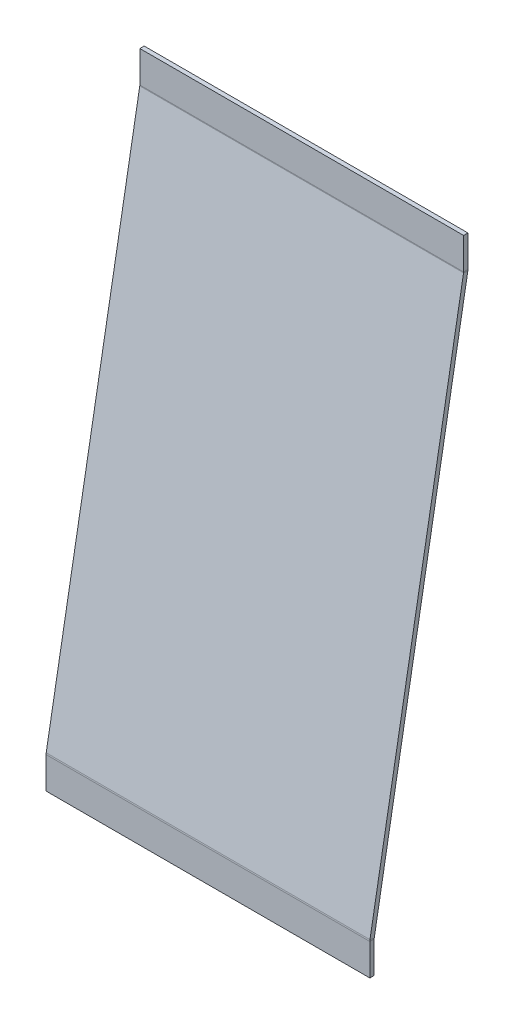
ISO-10303-21;
HEADER;
FILE_DESCRIPTION(('STEP AP214'),'2;1');
FILE_NAME('part.step','',(''),(''),'','','');
FILE_SCHEMA(('AUTOMOTIVE_DESIGN { 1 0 10303 214 1 1 1 1 }'));
ENDSEC;
DATA;
#1=APPLICATION_CONTEXT('core data for automotive mechanical design processes');
#2=APPLICATION_PROTOCOL_DEFINITION('international standard','automotive_design',2000,#1);
#3=PRODUCT_CONTEXT('',#1,'mechanical');
#4=PRODUCT('Part','Part','',(#3));
#5=PRODUCT_RELATED_PRODUCT_CATEGORY('part','',(#4));
#6=PRODUCT_DEFINITION_FORMATION('','',#4);
#7=PRODUCT_DEFINITION_CONTEXT('part definition',#1,'design');
#8=PRODUCT_DEFINITION('design','',#6,#7);
#9=PRODUCT_DEFINITION_SHAPE('','',#8);
#10=(LENGTH_UNIT() NAMED_UNIT(*) SI_UNIT(.MILLI.,.METRE.));
#11=(NAMED_UNIT(*) PLANE_ANGLE_UNIT() SI_UNIT($,.RADIAN.));
#12=(NAMED_UNIT(*) SI_UNIT($,.STERADIAN.) SOLID_ANGLE_UNIT());
#13=UNCERTAINTY_MEASURE_WITH_UNIT(LENGTH_MEASURE(1.E-05),#10,'distance_accuracy_value','');
#14=(GEOMETRIC_REPRESENTATION_CONTEXT(3) GLOBAL_UNCERTAINTY_ASSIGNED_CONTEXT((#13)) GLOBAL_UNIT_ASSIGNED_CONTEXT((#10,
#11,#12)) REPRESENTATION_CONTEXT('',''));
#15=CARTESIAN_POINT('',(0.,0.,0.));
#16=DIRECTION('',(0.,0.,1.));
#17=DIRECTION('',(1.,0.,0.));
#18=AXIS2_PLACEMENT_3D('',#15,#16,#17);
#19=CARTESIAN_POINT('',(0.,0.0347296355333861,0.196961550602442));
#20=DIRECTION('',(1.,0.,0.));
#21=DIRECTION('',(0.,-0.984807753012208,0.173648177666931));
#22=AXIS2_PLACEMENT_3D('',#19,#20,#21);
#23=PLANE('',#22);
#24=DIRECTION('',(0.,0.984807753012208,-0.173648177666931));
#25=VECTOR('',#24,1.);
#26=CARTESIAN_POINT('',(0.,-0.0347296355333862,-0.196961550602442));
#27=LINE('',#26,#25);
#28=CARTESIAN_POINT('',(0.,49.1711942094205,-8.87329353515391));
#29=VERTEX_POINT('',#28);
#30=CARTESIAN_POINT('',(0.,-0.000265829876988972,-0.203038449397557));
#31=VERTEX_POINT('',#30);
#32=EDGE_CURVE('E244',#29,#31,#27,.F.);
#33=ORIENTED_EDGE('',*,*,#32,.T.);
#34=DIRECTION('',(0.,0.17364817766693,0.984807753012208));
#35=VECTOR('',#34,1.);
#36=CARTESIAN_POINT('',(0.,-0.00026582987699442,-0.20303844939759));
#37=LINE('',#36,#35);
#38=CARTESIAN_POINT('',(0.,0.0691934411897775,0.190884651807293));
#39=VERTEX_POINT('',#38);
#40=EDGE_CURVE('E181',#31,#39,#37,.T.);
#41=ORIENTED_EDGE('',*,*,#40,.T.);
#42=DIRECTION('',(0.,-0.984807753012208,0.173648177666931));
#43=VECTOR('',#42,1.);
#44=CARTESIAN_POINT('',(0.,0.0347296355333861,0.196961550602442));
#45=LINE('',#44,#43);
#46=CARTESIAN_POINT('',(0.,49.2406534804873,-8.47937043394903));
#47=VERTEX_POINT('',#46);
#48=EDGE_CURVE('E54',#47,#39,#45,.T.);
#49=ORIENTED_EDGE('',*,*,#48,.F.);
#50=DIRECTION('',(0.,-0.173648177666959,-0.984807753012203));
#51=VECTOR('',#50,1.);
#52=CARTESIAN_POINT('',(0.,49.2406534804873,-8.47937043394903));
#53=LINE('',#52,#51);
#54=EDGE_CURVE('E231',#47,#29,#53,.T.);
#55=ORIENTED_EDGE('',*,*,#54,.T.);
#56=EDGE_LOOP('',(#33,#41,#49,#55));
#57=FACE_BOUND('',#56,.T.);
#58=ADVANCED_FACE('F45',(#57),#23,.F.);
#59=CARTESIAN_POINT('',(30.,0.0347296355333861,0.196961550602442));
#60=DIRECTION('',(0.,-0.173648177666931,-0.984807753012208));
#61=DIRECTION('',(0.,0.984807753012208,-0.173648177666931));
#62=AXIS2_PLACEMENT_3D('',#59,#60,#61);
#63=PLANE('',#62);
#64=DIRECTION('',(-1.,0.,0.));
#65=VECTOR('',#64,1.);
#66=CARTESIAN_POINT('',(0.,0.0691934411897775,0.190884651807293));
#67=LINE('',#66,#65);
#68=CARTESIAN_POINT('',(30.,0.069193441189783,0.190884651807326));
#69=VERTEX_POINT('',#68);
#70=EDGE_CURVE('E174',#39,#69,#67,.F.);
#71=ORIENTED_EDGE('',*,*,#70,.T.);
#72=DIRECTION('',(0.,-0.984807753012208,0.173648177666931));
#73=VECTOR('',#72,1.);
#74=CARTESIAN_POINT('',(30.,0.0347296355333861,0.196961550602442));
#75=LINE('',#74,#73);
#76=CARTESIAN_POINT('',(30.,49.2406534804873,-8.47937043394897));
#77=VERTEX_POINT('',#76);
#78=EDGE_CURVE('E11',#77,#69,#75,.T.);
#79=ORIENTED_EDGE('',*,*,#78,.F.);
#80=DIRECTION('',(-1.,0.,0.));
#81=VECTOR('',#80,1.);
#82=CARTESIAN_POINT('',(0.,49.2406534804873,-8.47937043394903));
#83=LINE('',#82,#81);
#84=EDGE_CURVE('E237',#47,#77,#83,.F.);
#85=ORIENTED_EDGE('',*,*,#84,.F.);
#86=ORIENTED_EDGE('',*,*,#48,.T.);
#87=EDGE_LOOP('',(#71,#79,#85,#86));
#88=FACE_BOUND('',#87,.T.);
#89=ADVANCED_FACE('F283',(#88),#63,.F.);
#90=CARTESIAN_POINT('',(30.,-0.0347296355333862,-0.196961550602442));
#91=DIRECTION('',(0.,-0.173648177666931,-0.984807753012208));
#92=DIRECTION('',(0.,0.984807753012208,-0.173648177666931));
#93=AXIS2_PLACEMENT_3D('',#90,#91,#92);
#94=PLANE('',#93);
#95=DIRECTION('',(0.,0.984807753012208,-0.173648177666931));
#96=VECTOR('',#95,1.);
#97=CARTESIAN_POINT('',(30.,-0.0347296355333862,-0.196961550602442));
#98=LINE('',#97,#96);
#99=CARTESIAN_POINT('',(30.,49.1711942094206,-8.87329353515385));
#100=VERTEX_POINT('',#99);
#101=CARTESIAN_POINT('',(30.,-0.000265829876989304,-0.203038449397557));
#102=VERTEX_POINT('',#101);
#103=EDGE_CURVE('E49',#100,#102,#98,.F.);
#104=ORIENTED_EDGE('',*,*,#103,.T.);
#105=DIRECTION('',(-1.,0.,0.));
#106=VECTOR('',#105,1.);
#107=CARTESIAN_POINT('',(0.,-0.00026582987699442,-0.20303844939759));
#108=LINE('',#107,#106);
#109=EDGE_CURVE('E62',#31,#102,#108,.F.);
#110=ORIENTED_EDGE('',*,*,#109,.F.);
#111=ORIENTED_EDGE('',*,*,#32,.F.);
#112=DIRECTION('',(-1.,0.,0.));
#113=VECTOR('',#112,1.);
#114=CARTESIAN_POINT('',(0.,49.1711942094205,-8.87329353515391));
#115=LINE('',#114,#113);
#116=EDGE_CURVE('E224',#29,#100,#115,.F.);
#117=ORIENTED_EDGE('',*,*,#116,.T.);
#118=EDGE_LOOP('',(#104,#110,#111,#117));
#119=FACE_BOUND('',#118,.T.);
#120=ADVANCED_FACE('F249',(#119),#94,.T.);
#121=CARTESIAN_POINT('',(30.,0.0347296355333861,0.196961550602442));
#122=DIRECTION('',(1.,0.,0.));
#123=DIRECTION('',(0.,-0.984807753012208,0.173648177666931));
#124=AXIS2_PLACEMENT_3D('',#121,#122,#123);
#125=PLANE('',#124);
#126=DIRECTION('',(0.,0.17364817766693,0.984807753012208));
#127=VECTOR('',#126,1.);
#128=CARTESIAN_POINT('',(30.,-0.000265829876989337,-0.203038449397558));
#129=LINE('',#128,#127);
#130=EDGE_CURVE('E69',#102,#69,#129,.T.);
#131=ORIENTED_EDGE('',*,*,#130,.F.);
#132=ORIENTED_EDGE('',*,*,#103,.F.);
#133=DIRECTION('',(0.,-0.173648177666958,-0.984807753012203));
#134=VECTOR('',#133,1.);
#135=CARTESIAN_POINT('',(30.,49.2406534804873,-8.47937043394897));
#136=LINE('',#135,#134);
#137=EDGE_CURVE('E241',#77,#100,#136,.T.);
#138=ORIENTED_EDGE('',*,*,#137,.F.);
#139=ORIENTED_EDGE('',*,*,#78,.T.);
#140=EDGE_LOOP('',(#131,#132,#138,#139));
#141=FACE_BOUND('',#140,.T.);
#142=ADVANCED_FACE('F47',(#141),#125,.T.);
#143=CARTESIAN_POINT('',(30.,49.3101127515541,-8.08544733274406));
#144=DIRECTION('',(1.,0.,0.));
#145=DIRECTION('',(0.,0.,-1.));
#146=AXIS2_PLACEMENT_3D('',#143,#144,#145);
#147=PLANE('',#146);
#148=DIRECTION('',(0.,0.,-1.));
#149=VECTOR('',#148,1.);
#150=CARTESIAN_POINT('',(30.,49.3101127515541,-8.48544733274409));
#151=LINE('',#150,#149);
#152=CARTESIAN_POINT('',(30.,49.3101127515541,-8.48544733274409));
#153=VERTEX_POINT('',#152);
#154=CARTESIAN_POINT('',(30.,49.3101127515541,-8.88544733274409));
#155=VERTEX_POINT('',#154);
#156=EDGE_CURVE('E191',#153,#155,#151,.T.);
#157=ORIENTED_EDGE('',*,*,#156,.F.);
#158=CARTESIAN_POINT('',(30.,49.3101127515541,-8.08544733274406));
#159=DIRECTION('',(-1.,0.,0.));
#160=DIRECTION('',(0.,0.,1.));
#161=AXIS2_PLACEMENT_3D('',#158,#159,#160);
#162=CIRCLE('',#161,0.400000000000025);
#163=EDGE_CURVE('E234',#77,#153,#162,.F.);
#164=ORIENTED_EDGE('',*,*,#163,.F.);
#165=ORIENTED_EDGE('',*,*,#137,.T.);
#166=CARTESIAN_POINT('',(30.,49.3101127515541,-8.08544733274406));
#167=DIRECTION('',(-1.,0.,0.));
#168=DIRECTION('',(0.,0.,1.));
#169=AXIS2_PLACEMENT_3D('',#166,#167,#168);
#170=CIRCLE('',#169,0.800000000000025);
#171=EDGE_CURVE('E227',#100,#155,#170,.F.);
#172=ORIENTED_EDGE('',*,*,#171,.T.);
#173=EDGE_LOOP('',(#157,#164,#165,#172));
#174=FACE_BOUND('',#173,.T.);
#175=ADVANCED_FACE('F297',(#174),#147,.T.);
#176=CARTESIAN_POINT('',(0.,49.3101127515541,-8.08544733274413));
#177=DIRECTION('',(1.,0.,0.));
#178=DIRECTION('',(0.,0.,-1.));
#179=AXIS2_PLACEMENT_3D('',#176,#177,#178);
#180=PLANE('',#179);
#181=CARTESIAN_POINT('',(0.,49.3101127515541,-8.08544733274413));
#182=DIRECTION('',(-1.,0.,0.));
#183=DIRECTION('',(0.,0.,1.));
#184=AXIS2_PLACEMENT_3D('',#181,#182,#183);
#185=CIRCLE('',#184,0.400000000000025);
#186=CARTESIAN_POINT('',(0.,49.3101127515541,-8.48544733274415));
#187=VERTEX_POINT('',#186);
#188=EDGE_CURVE('E223',#187,#47,#185,.T.);
#189=ORIENTED_EDGE('',*,*,#188,.F.);
#190=DIRECTION('',(0.,0.,-1.));
#191=VECTOR('',#190,1.);
#192=CARTESIAN_POINT('',(0.,49.3101127515541,-8.48544733274409));
#193=LINE('',#192,#191);
#194=CARTESIAN_POINT('',(0.,49.3101127515541,-8.88544733274409));
#195=VERTEX_POINT('',#194);
#196=EDGE_CURVE('E196',#187,#195,#193,.T.);
#197=ORIENTED_EDGE('',*,*,#196,.T.);
#198=CARTESIAN_POINT('',(0.,49.3101127515541,-8.08544733274413));
#199=DIRECTION('',(-1.,0.,0.));
#200=DIRECTION('',(0.,0.,1.));
#201=AXIS2_PLACEMENT_3D('',#198,#199,#200);
#202=CIRCLE('',#201,0.800000000000025);
#203=EDGE_CURVE('E228',#195,#29,#202,.T.);
#204=ORIENTED_EDGE('',*,*,#203,.T.);
#205=ORIENTED_EDGE('',*,*,#54,.F.);
#206=EDGE_LOOP('',(#189,#197,#204,#205));
#207=FACE_BOUND('',#206,.T.);
#208=ADVANCED_FACE('F293',(#207),#180,.F.);
#209=CARTESIAN_POINT('',(0.,49.3101127515541,-8.08544733274413));
#210=DIRECTION('',(-1.,0.,0.));
#211=DIRECTION('',(0.,0.,-1.));
#212=AXIS2_PLACEMENT_3D('',#209,#210,#211);
#213=CYLINDRICAL_SURFACE('',#212,0.800000000000025);
#214=ORIENTED_EDGE('',*,*,#116,.F.);
#215=ORIENTED_EDGE('',*,*,#203,.F.);
#216=DIRECTION('',(1.,0.,0.));
#217=VECTOR('',#216,1.);
#218=CARTESIAN_POINT('',(0.,49.3101127515541,-8.88544733274409));
#219=LINE('',#218,#217);
#220=EDGE_CURVE('E199',#195,#155,#219,.T.);
#221=ORIENTED_EDGE('',*,*,#220,.T.);
#222=ORIENTED_EDGE('',*,*,#171,.F.);
#223=EDGE_LOOP('',(#214,#215,#221,#222));
#224=FACE_BOUND('',#223,.T.);
#225=ADVANCED_FACE('F296',(#224),#213,.T.);
#226=CARTESIAN_POINT('',(0.,49.3101127515541,-8.08544733274413));
#227=DIRECTION('',(-1.,0.,0.));
#228=DIRECTION('',(0.,0.,-1.));
#229=AXIS2_PLACEMENT_3D('',#226,#227,#228);
#230=CYLINDRICAL_SURFACE('',#229,0.400000000000025);
#231=ORIENTED_EDGE('',*,*,#84,.T.);
#232=ORIENTED_EDGE('',*,*,#163,.T.);
#233=DIRECTION('',(-1.,0.,0.));
#234=VECTOR('',#233,1.);
#235=CARTESIAN_POINT('',(30.,49.3101127515541,-8.48544733274409));
#236=LINE('',#235,#234);
#237=EDGE_CURVE('E194',#153,#187,#236,.T.);
#238=ORIENTED_EDGE('',*,*,#237,.T.);
#239=ORIENTED_EDGE('',*,*,#188,.T.);
#240=EDGE_LOOP('',(#231,#232,#238,#239));
#241=FACE_BOUND('',#240,.T.);
#242=ADVANCED_FACE('F302',(#241),#230,.F.);
#243=CARTESIAN_POINT('',(0.,52.2401218207334,-8.88544733274411));
#244=DIRECTION('',(1.,0.,0.));
#245=DIRECTION('',(0.,0.,-1.));
#246=AXIS2_PLACEMENT_3D('',#243,#244,#245);
#247=PLANE('',#246);
#248=ORIENTED_EDGE('',*,*,#196,.F.);
#249=DIRECTION('',(0.,1.,0.));
#250=VECTOR('',#249,1.);
#251=CARTESIAN_POINT('',(0.,52.2401218207334,-8.48544733274411));
#252=LINE('',#251,#250);
#253=CARTESIAN_POINT('',(0.,52.2401218207334,-8.48544733274411));
#254=VERTEX_POINT('',#253);
#255=EDGE_CURVE('E203',#187,#254,#252,.T.);
#256=ORIENTED_EDGE('',*,*,#255,.T.);
#257=DIRECTION('',(0.,0.,1.));
#258=VECTOR('',#257,1.);
#259=CARTESIAN_POINT('',(0.,52.2401218207334,-8.88544733274411));
#260=LINE('',#259,#258);
#261=CARTESIAN_POINT('',(0.,52.2401218207334,-8.88544733274411));
#262=VERTEX_POINT('',#261);
#263=EDGE_CURVE('E220',#262,#254,#260,.T.);
#264=ORIENTED_EDGE('',*,*,#263,.F.);
#265=DIRECTION('',(0.,1.,0.));
#266=VECTOR('',#265,1.);
#267=CARTESIAN_POINT('',(0.,52.2401218207334,-8.88544733274411));
#268=LINE('',#267,#266);
#269=EDGE_CURVE('E204',#195,#262,#268,.T.);
#270=ORIENTED_EDGE('',*,*,#269,.F.);
#271=EDGE_LOOP('',(#248,#256,#264,#270));
#272=FACE_BOUND('',#271,.T.);
#273=ADVANCED_FACE('F305',(#272),#247,.F.);
#274=CARTESIAN_POINT('',(30.,49.2751172861437,-8.88544733274409));
#275=DIRECTION('',(-1.,0.,0.));
#276=DIRECTION('',(0.,0.,1.));
#277=AXIS2_PLACEMENT_3D('',#274,#275,#276);
#278=PLANE('',#277);
#279=ORIENTED_EDGE('',*,*,#156,.T.);
#280=DIRECTION('',(0.,-1.,0.));
#281=VECTOR('',#280,1.);
#282=CARTESIAN_POINT('',(30.,49.2751172861437,-8.88544733274409));
#283=LINE('',#282,#281);
#284=CARTESIAN_POINT('',(30.,52.2401218207334,-8.88544733274411));
#285=VERTEX_POINT('',#284);
#286=EDGE_CURVE('E209',#285,#155,#283,.T.);
#287=ORIENTED_EDGE('',*,*,#286,.F.);
#288=DIRECTION('',(0.,0.,1.));
#289=VECTOR('',#288,1.);
#290=CARTESIAN_POINT('',(30.,52.2401218207334,-8.88544733274411));
#291=LINE('',#290,#289);
#292=CARTESIAN_POINT('',(30.,52.2401218207334,-8.48544733274411));
#293=VERTEX_POINT('',#292);
#294=EDGE_CURVE('E212',#285,#293,#291,.T.);
#295=ORIENTED_EDGE('',*,*,#294,.T.);
#296=DIRECTION('',(0.,-1.,0.));
#297=VECTOR('',#296,1.);
#298=CARTESIAN_POINT('',(30.,49.2751172861437,-8.48544733274409));
#299=LINE('',#298,#297);
#300=EDGE_CURVE('E207',#293,#153,#299,.T.);
#301=ORIENTED_EDGE('',*,*,#300,.T.);
#302=EDGE_LOOP('',(#279,#287,#295,#301));
#303=FACE_BOUND('',#302,.T.);
#304=ADVANCED_FACE('F312',(#303),#278,.F.);
#305=CARTESIAN_POINT('',(0.,0.,-8.88544733274374));
#306=DIRECTION('',(0.,0.,1.));
#307=DIRECTION('',(0.,-1.,0.));
#308=AXIS2_PLACEMENT_3D('',#305,#306,#307);
#309=PLANE('',#308);
#310=ORIENTED_EDGE('',*,*,#220,.F.);
#311=ORIENTED_EDGE('',*,*,#269,.T.);
#312=DIRECTION('',(1.,0.,0.));
#313=VECTOR('',#312,1.);
#314=CARTESIAN_POINT('',(30.,52.2401218207334,-8.88544733274411));
#315=LINE('',#314,#313);
#316=EDGE_CURVE('E206',#262,#285,#315,.T.);
#317=ORIENTED_EDGE('',*,*,#316,.T.);
#318=ORIENTED_EDGE('',*,*,#286,.T.);
#319=EDGE_LOOP('',(#310,#311,#317,#318));
#320=FACE_BOUND('',#319,.T.);
#321=ADVANCED_FACE('F320',(#320),#309,.F.);
#322=CARTESIAN_POINT('',(0.,0.,-8.48544733274374));
#323=DIRECTION('',(0.,0.,1.));
#324=DIRECTION('',(0.,-1.,0.));
#325=AXIS2_PLACEMENT_3D('',#322,#323,#324);
#326=PLANE('',#325);
#327=ORIENTED_EDGE('',*,*,#255,.F.);
#328=ORIENTED_EDGE('',*,*,#237,.F.);
#329=ORIENTED_EDGE('',*,*,#300,.F.);
#330=DIRECTION('',(1.,0.,0.));
#331=VECTOR('',#330,1.);
#332=CARTESIAN_POINT('',(30.,52.2401218207334,-8.48544733274411));
#333=LINE('',#332,#331);
#334=EDGE_CURVE('E214',#254,#293,#333,.T.);
#335=ORIENTED_EDGE('',*,*,#334,.F.);
#336=EDGE_LOOP('',(#327,#328,#329,#335));
#337=FACE_BOUND('',#336,.T.);
#338=ADVANCED_FACE('F316',(#337),#326,.T.);
#339=CARTESIAN_POINT('',(30.,52.2401218207334,-8.88544733274411));
#340=DIRECTION('',(0.,-1.,0.));
#341=DIRECTION('',(0.,0.,-1.));
#342=AXIS2_PLACEMENT_3D('',#339,#340,#341);
#343=PLANE('',#342);
#344=ORIENTED_EDGE('',*,*,#334,.T.);
#345=ORIENTED_EDGE('',*,*,#294,.F.);
#346=ORIENTED_EDGE('',*,*,#316,.F.);
#347=ORIENTED_EDGE('',*,*,#263,.T.);
#348=EDGE_LOOP('',(#344,#345,#346,#347));
#349=FACE_BOUND('',#348,.T.);
#350=ADVANCED_FACE('F314',(#349),#343,.F.);
#351=CARTESIAN_POINT('',(30.,-0.0697251009437545,-0.596961550602402));
#352=DIRECTION('',(1.,0.,0.));
#353=DIRECTION('',(0.,0.,-1.));
#354=AXIS2_PLACEMENT_3D('',#351,#352,#353);
#355=PLANE('',#354);
#356=DIRECTION('',(0.,0.,1.));
#357=VECTOR('',#356,1.);
#358=CARTESIAN_POINT('',(30.,-0.0697251009437544,-0.196961550602441));
#359=LINE('',#358,#357);
#360=CARTESIAN_POINT('',(30.,-0.0697251009437516,-0.196961550602441));
#361=VERTEX_POINT('',#360);
#362=CARTESIAN_POINT('',(30.,-0.0697251009437488,0.203038449397559));
#363=VERTEX_POINT('',#362);
#364=EDGE_CURVE('E144',#361,#363,#359,.T.);
#365=ORIENTED_EDGE('',*,*,#364,.F.);
#366=CARTESIAN_POINT('',(30.,-0.0697251009437545,-0.596961550602402));
#367=DIRECTION('',(-1.,0.,0.));
#368=DIRECTION('',(0.,0.,1.));
#369=AXIS2_PLACEMENT_3D('',#366,#367,#368);
#370=CIRCLE('',#369,0.399999999999961);
#371=EDGE_CURVE('E184',#102,#361,#370,.F.);
#372=ORIENTED_EDGE('',*,*,#371,.F.);
#373=ORIENTED_EDGE('',*,*,#130,.T.);
#374=CARTESIAN_POINT('',(30.,-0.0697251009437545,-0.596961550602402));
#375=DIRECTION('',(-1.,0.,0.));
#376=DIRECTION('',(0.,0.,1.));
#377=AXIS2_PLACEMENT_3D('',#374,#375,#376);
#378=CIRCLE('',#377,0.799999999999961);
#379=EDGE_CURVE('E177',#69,#363,#378,.F.);
#380=ORIENTED_EDGE('',*,*,#379,.T.);
#381=EDGE_LOOP('',(#365,#372,#373,#380));
#382=FACE_BOUND('',#381,.T.);
#383=ADVANCED_FACE('F257',(#382),#355,.T.);
#384=CARTESIAN_POINT('',(0.,-0.0697251009437596,-0.596961550602435));
#385=DIRECTION('',(1.,0.,0.));
#386=DIRECTION('',(0.,0.,-1.));
#387=AXIS2_PLACEMENT_3D('',#384,#385,#386);
#388=PLANE('',#387);
#389=CARTESIAN_POINT('',(0.,-0.0697251009437596,-0.596961550602435));
#390=DIRECTION('',(-1.,0.,0.));
#391=DIRECTION('',(0.,0.,1.));
#392=AXIS2_PLACEMENT_3D('',#389,#390,#391);
#393=CIRCLE('',#392,0.399999999999961);
#394=CARTESIAN_POINT('',(0.,-0.0697251009437567,-0.196961550602474));
#395=VERTEX_POINT('',#394);
#396=EDGE_CURVE('E172',#395,#31,#393,.T.);
#397=ORIENTED_EDGE('',*,*,#396,.F.);
#398=DIRECTION('',(0.,0.,1.));
#399=VECTOR('',#398,1.);
#400=CARTESIAN_POINT('',(0.,-0.0697251009437597,-0.196961550602442));
#401=LINE('',#400,#399);
#402=CARTESIAN_POINT('',(0.,-0.069725100943757,0.203038449397559));
#403=VERTEX_POINT('',#402);
#404=EDGE_CURVE('E261',#395,#403,#401,.T.);
#405=ORIENTED_EDGE('',*,*,#404,.T.);
#406=CARTESIAN_POINT('',(0.,-0.0697251009437596,-0.596961550602435));
#407=DIRECTION('',(-1.,0.,0.));
#408=DIRECTION('',(0.,0.,1.));
#409=AXIS2_PLACEMENT_3D('',#406,#407,#408);
#410=CIRCLE('',#409,0.799999999999961);
#411=EDGE_CURVE('E178',#403,#39,#410,.T.);
#412=ORIENTED_EDGE('',*,*,#411,.T.);
#413=ORIENTED_EDGE('',*,*,#40,.F.);
#414=EDGE_LOOP('',(#397,#405,#412,#413));
#415=FACE_BOUND('',#414,.T.);
#416=ADVANCED_FACE('F267',(#415),#388,.F.);
#417=CARTESIAN_POINT('',(0.,-0.0697251009437596,-0.596961550602435));
#418=DIRECTION('',(-1.,0.,0.));
#419=DIRECTION('',(0.,0.,1.));
#420=AXIS2_PLACEMENT_3D('',#417,#418,#419);
#421=CYLINDRICAL_SURFACE('',#420,0.799999999999961);
#422=ORIENTED_EDGE('',*,*,#70,.F.);
#423=ORIENTED_EDGE('',*,*,#411,.F.);
#424=DIRECTION('',(-1.,0.,0.));
#425=VECTOR('',#424,1.);
#426=CARTESIAN_POINT('',(0.,-0.0697251009437597,0.203038449397559));
#427=LINE('',#426,#425);
#428=EDGE_CURVE('E168',#363,#403,#427,.T.);
#429=ORIENTED_EDGE('',*,*,#428,.F.);
#430=ORIENTED_EDGE('',*,*,#379,.F.);
#431=EDGE_LOOP('',(#422,#423,#429,#430));
#432=FACE_BOUND('',#431,.T.);
#433=ADVANCED_FACE('F330',(#432),#421,.T.);
#434=CARTESIAN_POINT('',(0.,-0.0697251009437596,-0.596961550602435));
#435=DIRECTION('',(-1.,0.,0.));
#436=DIRECTION('',(0.,0.,1.));
#437=AXIS2_PLACEMENT_3D('',#434,#435,#436);
#438=CYLINDRICAL_SURFACE('',#437,0.399999999999961);
#439=ORIENTED_EDGE('',*,*,#109,.T.);
#440=ORIENTED_EDGE('',*,*,#371,.T.);
#441=DIRECTION('',(-1.,0.,0.));
#442=VECTOR('',#441,1.);
#443=CARTESIAN_POINT('',(30.,-0.0697251009437544,-0.196961550602441));
#444=LINE('',#443,#442);
#445=EDGE_CURVE('E259',#361,#395,#444,.T.);
#446=ORIENTED_EDGE('',*,*,#445,.T.);
#447=ORIENTED_EDGE('',*,*,#396,.T.);
#448=EDGE_LOOP('',(#439,#440,#446,#447));
#449=FACE_BOUND('',#448,.T.);
#450=ADVANCED_FACE('F253',(#449),#438,.F.);
#451=CARTESIAN_POINT('',(0.,-0.0347296355333833,0.203038449397558));
#452=DIRECTION('',(-1.,0.,0.));
#453=DIRECTION('',(0.,0.,1.));
#454=AXIS2_PLACEMENT_3D('',#451,#452,#453);
#455=PLANE('',#454);
#456=DIRECTION('',(0.,1.,0.));
#457=VECTOR('',#456,1.);
#458=CARTESIAN_POINT('',(0.,-0.0347296355333833,0.203038449397558));
#459=LINE('',#458,#457);
#460=CARTESIAN_POINT('',(0.,-2.99973417012301,0.20303844939758));
#461=VERTEX_POINT('',#460);
#462=EDGE_CURVE('E158',#461,#403,#459,.T.);
#463=ORIENTED_EDGE('',*,*,#462,.T.);
#464=ORIENTED_EDGE('',*,*,#404,.F.);
#465=DIRECTION('',(0.,1.,0.));
#466=VECTOR('',#465,1.);
#467=CARTESIAN_POINT('',(0.,-0.0347296355333862,-0.196961550602442));
#468=LINE('',#467,#466);
#469=CARTESIAN_POINT('',(0.,-2.99973417012302,-0.19696155060242));
#470=VERTEX_POINT('',#469);
#471=EDGE_CURVE('E149',#470,#395,#468,.T.);
#472=ORIENTED_EDGE('',*,*,#471,.F.);
#473=DIRECTION('',(0.,0.,-1.));
#474=VECTOR('',#473,1.);
#475=CARTESIAN_POINT('',(0.,-2.99973417012301,0.20303844939758));
#476=LINE('',#475,#474);
#477=EDGE_CURVE('E157',#461,#470,#476,.T.);
#478=ORIENTED_EDGE('',*,*,#477,.F.);
#479=EDGE_LOOP('',(#463,#464,#472,#478));
#480=FACE_BOUND('',#479,.T.);
#481=ADVANCED_FACE('F270',(#480),#455,.T.);
#482=CARTESIAN_POINT('',(30.,-2.99973417012301,0.20303844939758));
#483=DIRECTION('',(1.,0.,0.));
#484=DIRECTION('',(0.,0.,-1.));
#485=AXIS2_PLACEMENT_3D('',#482,#483,#484);
#486=PLANE('',#485);
#487=DIRECTION('',(0.,-1.,0.));
#488=VECTOR('',#487,1.);
#489=CARTESIAN_POINT('',(30.,-2.99973417012302,-0.19696155060242));
#490=LINE('',#489,#488);
#491=CARTESIAN_POINT('',(30.,-2.99973417012302,-0.19696155060242));
#492=VERTEX_POINT('',#491);
#493=EDGE_CURVE('E166',#361,#492,#490,.T.);
#494=ORIENTED_EDGE('',*,*,#493,.F.);
#495=ORIENTED_EDGE('',*,*,#364,.T.);
#496=DIRECTION('',(0.,-1.,0.));
#497=VECTOR('',#496,1.);
#498=CARTESIAN_POINT('',(30.,-2.99973417012301,0.20303844939758));
#499=LINE('',#498,#497);
#500=CARTESIAN_POINT('',(30.,-2.99973417012301,0.20303844939758));
#501=VERTEX_POINT('',#500);
#502=EDGE_CURVE('E138',#363,#501,#499,.T.);
#503=ORIENTED_EDGE('',*,*,#502,.T.);
#504=DIRECTION('',(0.,0.,-1.));
#505=VECTOR('',#504,1.);
#506=CARTESIAN_POINT('',(30.,-2.99973417012301,0.20303844939758));
#507=LINE('',#506,#505);
#508=EDGE_CURVE('E142',#501,#492,#507,.T.);
#509=ORIENTED_EDGE('',*,*,#508,.T.);
#510=EDGE_LOOP('',(#494,#495,#503,#509));
#511=FACE_BOUND('',#510,.T.);
#512=ADVANCED_FACE('F141',(#511),#486,.T.);
#513=CARTESIAN_POINT('',(0.,0.,0.203038449397558));
#514=DIRECTION('',(0.,0.,1.));
#515=DIRECTION('',(0.,-1.,0.));
#516=AXIS2_PLACEMENT_3D('',#513,#514,#515);
#517=PLANE('',#516);
#518=ORIENTED_EDGE('',*,*,#502,.F.);
#519=ORIENTED_EDGE('',*,*,#428,.T.);
#520=ORIENTED_EDGE('',*,*,#462,.F.);
#521=DIRECTION('',(-1.,0.,0.));
#522=VECTOR('',#521,1.);
#523=CARTESIAN_POINT('',(0.,-2.99973417012301,0.20303844939758));
#524=LINE('',#523,#522);
#525=EDGE_CURVE('E148',#501,#461,#524,.T.);
#526=ORIENTED_EDGE('',*,*,#525,.F.);
#527=EDGE_LOOP('',(#518,#519,#520,#526));
#528=FACE_BOUND('',#527,.T.);
#529=ADVANCED_FACE('F160',(#528),#517,.T.);
#530=CARTESIAN_POINT('',(0.,0.,-0.196961550602442));
#531=DIRECTION('',(0.,0.,1.));
#532=DIRECTION('',(0.,-1.,0.));
#533=AXIS2_PLACEMENT_3D('',#530,#531,#532);
#534=PLANE('',#533);
#535=ORIENTED_EDGE('',*,*,#445,.F.);
#536=ORIENTED_EDGE('',*,*,#493,.T.);
#537=DIRECTION('',(-1.,0.,0.));
#538=VECTOR('',#537,1.);
#539=CARTESIAN_POINT('',(0.,-2.99973417012302,-0.19696155060242));
#540=LINE('',#539,#538);
#541=EDGE_CURVE('E156',#492,#470,#540,.T.);
#542=ORIENTED_EDGE('',*,*,#541,.T.);
#543=ORIENTED_EDGE('',*,*,#471,.T.);
#544=EDGE_LOOP('',(#535,#536,#542,#543));
#545=FACE_BOUND('',#544,.T.);
#546=ADVANCED_FACE('F272',(#545),#534,.F.);
#547=CARTESIAN_POINT('',(0.,-2.99973417012301,0.20303844939758));
#548=DIRECTION('',(0.,-1.,0.));
#549=DIRECTION('',(0.,0.,-1.));
#550=AXIS2_PLACEMENT_3D('',#547,#548,#549);
#551=PLANE('',#550);
#552=ORIENTED_EDGE('',*,*,#541,.F.);
#553=ORIENTED_EDGE('',*,*,#508,.F.);
#554=ORIENTED_EDGE('',*,*,#525,.T.);
#555=ORIENTED_EDGE('',*,*,#477,.T.);
#556=EDGE_LOOP('',(#552,#553,#554,#555));
#557=FACE_BOUND('',#556,.T.);
#558=ADVANCED_FACE('F153',(#557),#551,.T.);
#559=CLOSED_SHELL('',(#58,#89,#120,#142,#175,#208,#225,#242,#273,#304,#321,#338,#350,#383,#416,
#433,#450,#481,#512,#529,#546,#558));
#560=MANIFOLD_SOLID_BREP('B2',#559);
#561=ADVANCED_BREP_SHAPE_REPRESENTATION('',(#18,#560),#14);
#562=SHAPE_DEFINITION_REPRESENTATION(#9,#561);
ENDSEC;
END-ISO-10303-21;
